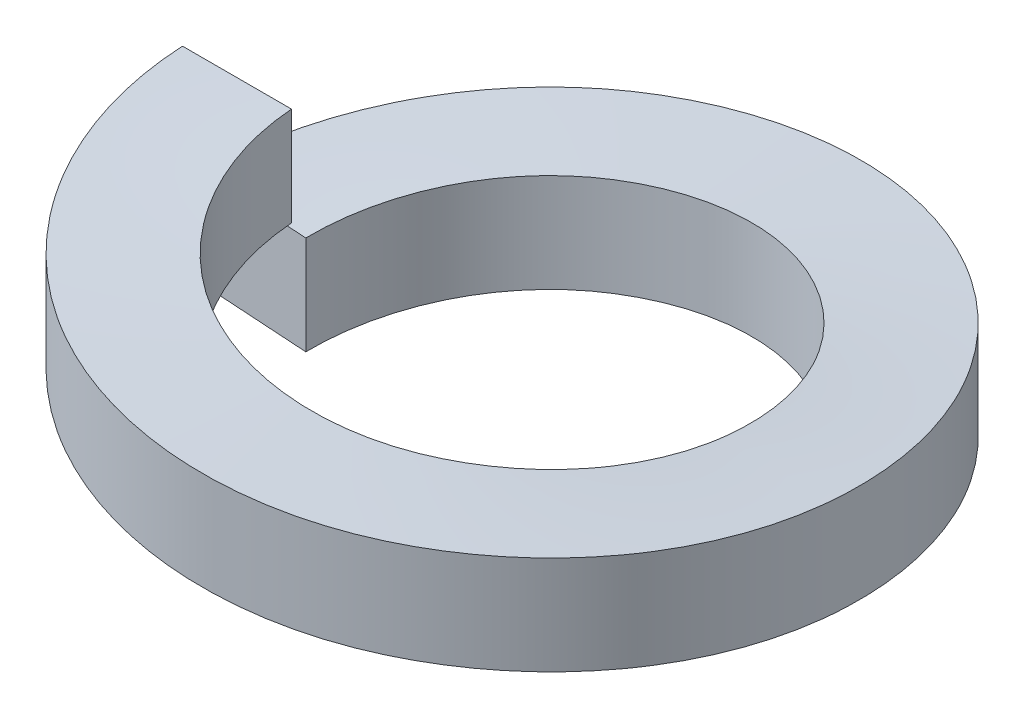
ISO-10303-21;
HEADER;
FILE_DESCRIPTION(('STEP AP214'),'2;1');
FILE_NAME('part.step','',(''),(''),'','','');
FILE_SCHEMA(('AUTOMOTIVE_DESIGN { 1 0 10303 214 1 1 1 1 }'));
ENDSEC;
DATA;
#1=APPLICATION_CONTEXT('core data for automotive mechanical design processes');
#2=APPLICATION_PROTOCOL_DEFINITION('international standard','automotive_design',2000,#1);
#3=PRODUCT_CONTEXT('',#1,'mechanical');
#4=PRODUCT('Part','Part','',(#3));
#5=PRODUCT_RELATED_PRODUCT_CATEGORY('part','',(#4));
#6=PRODUCT_DEFINITION_FORMATION('','',#4);
#7=PRODUCT_DEFINITION_CONTEXT('part definition',#1,'design');
#8=PRODUCT_DEFINITION('design','',#6,#7);
#9=PRODUCT_DEFINITION_SHAPE('','',#8);
#10=(LENGTH_UNIT() NAMED_UNIT(*) SI_UNIT(.MILLI.,.METRE.));
#11=(NAMED_UNIT(*) PLANE_ANGLE_UNIT() SI_UNIT($,.RADIAN.));
#12=(NAMED_UNIT(*) SI_UNIT($,.STERADIAN.) SOLID_ANGLE_UNIT());
#13=UNCERTAINTY_MEASURE_WITH_UNIT(LENGTH_MEASURE(1.E-05),#10,'distance_accuracy_value','');
#14=(GEOMETRIC_REPRESENTATION_CONTEXT(3) GLOBAL_UNCERTAINTY_ASSIGNED_CONTEXT((#13)) GLOBAL_UNIT_ASSIGNED_CONTEXT((#10,
#11,#12)) REPRESENTATION_CONTEXT('',''));
#15=CARTESIAN_POINT('',(0.,0.,0.));
#16=DIRECTION('',(0.,0.,1.));
#17=DIRECTION('',(1.,0.,0.));
#18=AXIS2_PLACEMENT_3D('',#15,#16,#17);
#19=CARTESIAN_POINT('',(-6.35,0.,0.));
#20=DIRECTION('',(0.,0.,1.));
#21=DIRECTION('',(1.,0.,0.));
#22=AXIS2_PLACEMENT_3D('',#19,#20,#21);
#23=PLANE('',#22);
#24=DIRECTION('',(0.,-1.,0.));
#25=VECTOR('',#24,1.);
#26=CARTESIAN_POINT('',(-6.35,1.9,0.));
#27=LINE('',#26,#25);
#28=CARTESIAN_POINT('',(-6.35,1.9,0.));
#29=VERTEX_POINT('',#28);
#30=CARTESIAN_POINT('',(-6.35,0.,0.));
#31=VERTEX_POINT('',#30);
#32=EDGE_CURVE('E74',#29,#31,#27,.T.);
#33=ORIENTED_EDGE('',*,*,#32,.F.);
#34=DIRECTION('',(-1.,0.,0.));
#35=VECTOR('',#34,1.);
#36=CARTESIAN_POINT('',(-6.35,1.9,0.));
#37=LINE('',#36,#35);
#38=CARTESIAN_POINT('',(-4.25,1.9,0.));
#39=VERTEX_POINT('',#38);
#40=EDGE_CURVE('E62',#39,#29,#37,.T.);
#41=ORIENTED_EDGE('',*,*,#40,.F.);
#42=DIRECTION('',(0.,1.,0.));
#43=VECTOR('',#42,1.);
#44=CARTESIAN_POINT('',(-4.25,1.9,0.));
#45=LINE('',#44,#43);
#46=CARTESIAN_POINT('',(-4.25,0.,0.));
#47=VERTEX_POINT('',#46);
#48=EDGE_CURVE('E67',#47,#39,#45,.T.);
#49=ORIENTED_EDGE('',*,*,#48,.F.);
#50=DIRECTION('',(1.,0.,0.));
#51=VECTOR('',#50,1.);
#52=CARTESIAN_POINT('',(-6.35,0.,0.));
#53=LINE('',#52,#51);
#54=EDGE_CURVE('E71',#31,#47,#53,.T.);
#55=ORIENTED_EDGE('',*,*,#54,.F.);
#56=EDGE_LOOP('',(#33,#41,#49,#55));
#57=FACE_BOUND('',#56,.T.);
#58=ADVANCED_FACE('F32',(#57),#23,.F.);
#59=CARTESIAN_POINT('',(-6.33746972551953,-2.28,-0.398719799011055));
#60=DIRECTION('',(-0.0627905195293,0.,0.998026728428272));
#61=DIRECTION('',(0.998026728428272,0.,0.0627905195293));
#62=AXIS2_PLACEMENT_3D('',#59,#60,#61);
#63=PLANE('',#62);
#64=DIRECTION('',(0.,-1.,0.));
#65=VECTOR('',#64,1.);
#66=CARTESIAN_POINT('',(-6.33746972551953,-0.38,-0.398719799011055));
#67=LINE('',#66,#65);
#68=CARTESIAN_POINT('',(-6.33746972551953,-0.38,-0.398719799011052));
#69=VERTEX_POINT('',#68);
#70=CARTESIAN_POINT('',(-6.33746972551953,-2.28,-0.398719799011052));
#71=VERTEX_POINT('',#70);
#72=EDGE_CURVE('E88',#69,#71,#67,.T.);
#73=ORIENTED_EDGE('',*,*,#72,.T.);
#74=DIRECTION('',(0.998026728428272,0.,0.0627905195293));
#75=VECTOR('',#74,1.);
#76=CARTESIAN_POINT('',(-6.33746972551953,-2.28,-0.398719799011055));
#77=LINE('',#76,#75);
#78=CARTESIAN_POINT('',(-4.24161359582016,-2.28,-0.266859707999523));
#79=VERTEX_POINT('',#78);
#80=EDGE_CURVE('E51',#71,#79,#77,.T.);
#81=ORIENTED_EDGE('',*,*,#80,.T.);
#82=DIRECTION('',(0.,1.,0.));
#83=VECTOR('',#82,1.);
#84=CARTESIAN_POINT('',(-4.24161359582016,-0.38,-0.266859707999525));
#85=LINE('',#84,#83);
#86=CARTESIAN_POINT('',(-4.24161359582016,-0.38,-0.266859707999523));
#87=VERTEX_POINT('',#86);
#88=EDGE_CURVE('E45',#79,#87,#85,.T.);
#89=ORIENTED_EDGE('',*,*,#88,.T.);
#90=DIRECTION('',(-0.998026728428272,0.,-0.0627905195293));
#91=VECTOR('',#90,1.);
#92=CARTESIAN_POINT('',(-6.33746972551953,-0.38,-0.398719799011055));
#93=LINE('',#92,#91);
#94=EDGE_CURVE('E11',#87,#69,#93,.T.);
#95=ORIENTED_EDGE('',*,*,#94,.T.);
#96=EDGE_LOOP('',(#73,#81,#89,#95));
#97=FACE_BOUND('',#96,.T.);
#98=ADVANCED_FACE('F133',(#97),#63,.T.);
#99=CARTESIAN_POINT('',(0.,0.,0.));
#100=DIRECTION('',(0.,-1.,0.));
#101=DIRECTION('',(0.,0.,-1.));
#102=AXIS2_PLACEMENT_3D('',#99,#100,#101);
#103=CYLINDRICAL_SURFACE('',#102,6.35);
#104=CARTESIAN_POINT('',(-6.35,0.,0.));
#105=CARTESIAN_POINT('',(-6.35,-0.19,3.62197605342543));
#106=CARTESIAN_POINT('',(-3.23241299001484,-0.38,5.46571187147505));
#107=CARTESIAN_POINT('',(-0.114825980029689,-0.57,7.30944768952467));
#108=CARTESIAN_POINT('',(3.05913583054592,-0.76,5.56454741827852));
#109=CARTESIAN_POINT('',(6.23309764112153,-0.95,3.81964714703237));
#110=CARTESIAN_POINT('',(6.3468666583224,-1.14,0.199458320146069));
#111=CARTESIAN_POINT('',(6.46063567552327,-1.33,-3.42073050674023));
#112=CARTESIAN_POINT('',(3.40250014811658,-1.52,-5.36148232693783));
#113=CARTESIAN_POINT('',(0.344364620709888,-1.71,-7.30223414713542));
#114=CARTESIAN_POINT('',(-2.88283967334619,-1.9,-5.6578914285961));
#115=CARTESIAN_POINT('',(-6.11004396740227,-2.09,-4.01354871005678));
#116=CARTESIAN_POINT('',(-6.33746972551953,-2.28,-0.398719799011049));
#117=(BOUNDED_CURVE() B_SPLINE_CURVE(2,(#104,#105,#106,#107,#108,#109,#110,#111,#112,#113,#114,
#115,#116),.UNSPECIFIED.,.F.,.F.) B_SPLINE_CURVE_WITH_KNOTS((3,2,2,2,2,2,3),(0.,
0.166666666666667,0.333333333333333,0.5,0.666666666666667,0.833333333333333,1.),
.UNSPECIFIED.) CURVE() GEOMETRIC_REPRESENTATION_ITEM() RATIONAL_B_SPLINE_CURVE((1.,
0.868631514438191,1.,0.868631514438191,1.,0.868631514438191,1.,0.868631514438191,1.,
0.868631514438191,1.,0.868631514438191,1.)) REPRESENTATION_ITEM(''));
#118=EDGE_CURVE('E90',#31,#71,#117,.T.);
#119=ORIENTED_EDGE('',*,*,#118,.T.);
#120=ORIENTED_EDGE('',*,*,#72,.F.);
#121=CARTESIAN_POINT('',(-6.35,1.9,0.));
#122=CARTESIAN_POINT('',(-6.35,1.71,3.62197605342543));
#123=CARTESIAN_POINT('',(-3.23241299001484,1.52,5.46571187147505));
#124=CARTESIAN_POINT('',(-0.114825980029689,1.33,7.30944768952467));
#125=CARTESIAN_POINT('',(3.05913583054592,1.14,5.56454741827852));
#126=CARTESIAN_POINT('',(6.23309764112153,0.95,3.81964714703237));
#127=CARTESIAN_POINT('',(6.3468666583224,0.76,0.199458320146069));
#128=CARTESIAN_POINT('',(6.46063567552327,0.57,-3.42073050674023));
#129=CARTESIAN_POINT('',(3.40250014811658,0.38,-5.36148232693783));
#130=CARTESIAN_POINT('',(0.344364620709888,0.19,-7.30223414713542));
#131=CARTESIAN_POINT('',(-2.88283967334619,0.,-5.6578914285961));
#132=CARTESIAN_POINT('',(-6.11004396740227,-0.19,-4.01354871005678));
#133=CARTESIAN_POINT('',(-6.33746972551953,-0.38,-0.398719799011049));
#134=(BOUNDED_CURVE() B_SPLINE_CURVE(2,(#121,#122,#123,#124,#125,#126,#127,#128,#129,#130,#131,
#132,#133),.UNSPECIFIED.,.F.,.F.) B_SPLINE_CURVE_WITH_KNOTS((3,2,2,2,2,2,3),(0.,
0.166666666666667,0.333333333333333,0.5,0.666666666666667,0.833333333333333,1.),
.UNSPECIFIED.) CURVE() GEOMETRIC_REPRESENTATION_ITEM() RATIONAL_B_SPLINE_CURVE((1.,
0.868631514438191,1.,0.868631514438191,1.,0.868631514438191,1.,0.868631514438191,1.,
0.868631514438191,1.,0.868631514438191,1.)) REPRESENTATION_ITEM(''));
#135=EDGE_CURVE('E84',#29,#69,#134,.T.);
#136=ORIENTED_EDGE('',*,*,#135,.F.);
#137=ORIENTED_EDGE('',*,*,#32,.T.);
#138=EDGE_LOOP('',(#119,#120,#136,#137));
#139=FACE_BOUND('',#138,.T.);
#140=ADVANCED_FACE('F87',(#139),#103,.T.);
#141=CARTESIAN_POINT('',(-6.35,0.,0.));
#142=CARTESIAN_POINT('',(-6.35,-0.19,3.62197605342543));
#143=CARTESIAN_POINT('',(-3.23241299001484,-0.38,5.46571187147505));
#144=CARTESIAN_POINT('',(-0.114825980029689,-0.57,7.30944768952467));
#145=CARTESIAN_POINT('',(3.05913583054592,-0.76,5.56454741827852));
#146=CARTESIAN_POINT('',(6.23309764112153,-0.95,3.81964714703237));
#147=CARTESIAN_POINT('',(6.3468666583224,-1.14,0.199458320146069));
#148=CARTESIAN_POINT('',(6.46063567552327,-1.33,-3.42073050674023));
#149=CARTESIAN_POINT('',(3.40250014811658,-1.52,-5.36148232693783));
#150=CARTESIAN_POINT('',(0.344364620709888,-1.71,-7.30223414713542));
#151=CARTESIAN_POINT('',(-2.88283967334619,-1.9,-5.6578914285961));
#152=CARTESIAN_POINT('',(-6.11004396740227,-2.09,-4.01354871005678));
#153=CARTESIAN_POINT('',(-6.33746972551953,-2.28,-0.398719799011049));
#154=CARTESIAN_POINT('',(-4.25,0.,0.));
#155=CARTESIAN_POINT('',(-4.25,-0.19,2.42415720111151));
#156=CARTESIAN_POINT('',(-2.16342601693907,-0.38,3.65815361476677));
#157=CARTESIAN_POINT('',(-0.0768520338781386,-0.57,4.89215002842202));
#158=CARTESIAN_POINT('',(2.04745311493231,-0.76,3.72430339018641));
#159=CARTESIAN_POINT('',(4.17175826374275,-0.95,2.5564567519508));
#160=CARTESIAN_POINT('',(4.24790288155436,-1.14,0.133495726082015));
#161=CARTESIAN_POINT('',(4.32404749936597,-1.33,-2.28946529978677));
#162=CARTESIAN_POINT('',(2.2772638786607,-1.52,-3.58839368338359));
#163=CARTESIAN_POINT('',(0.230480257955437,-1.71,-4.8873220669804));
#164=CARTESIAN_POINT('',(-1.92945962389312,-1.9,-3.78677772780054));
#165=CARTESIAN_POINT('',(-4.08939950574167,-2.09,-2.68623338862068));
#166=CARTESIAN_POINT('',(-4.24161359582016,-2.28,-0.266859707999521));
#167=(BOUNDED_SURFACE() B_SPLINE_SURFACE(1,2,((#141,#142,#143,#144,#145,#146,#147,#148,#149,
#150,#151,#152,#153),(#154,#155,#156,#157,#158,#159,#160,#161,#162,#163,#164,#165,#166)),
.UNSPECIFIED.,.F.,.F.,.F.) B_SPLINE_SURFACE_WITH_KNOTS((2,2),(3,2,2,2,2,2,3),(0.,1.),(0.,
0.166666666666667,0.333333333333333,0.5,0.666666666666667,0.833333333333333,1.),
.UNSPECIFIED.) GEOMETRIC_REPRESENTATION_ITEM() RATIONAL_B_SPLINE_SURFACE(((1.,0.868631514438191,
1.,0.868631514438191,1.,0.868631514438191,1.,0.868631514438191,1.,0.868631514438191,1.,
0.868631514438191,1.),(1.,0.868631514438191,1.,0.868631514438191,1.,0.868631514438191,1.,
0.868631514438191,1.,0.868631514438191,1.,0.868631514438191,1.))) REPRESENTATION_ITEM('') SURFACE());
#168=CARTESIAN_POINT('',(-4.25,0.,0.));
#169=CARTESIAN_POINT('',(-4.25,-0.19,2.42415720111151));
#170=CARTESIAN_POINT('',(-2.16342601693907,-0.38,3.65815361476677));
#171=CARTESIAN_POINT('',(-0.0768520338781386,-0.57,4.89215002842202));
#172=CARTESIAN_POINT('',(2.04745311493231,-0.76,3.72430339018641));
#173=CARTESIAN_POINT('',(4.17175826374275,-0.95,2.5564567519508));
#174=CARTESIAN_POINT('',(4.24790288155436,-1.14,0.133495726082015));
#175=CARTESIAN_POINT('',(4.32404749936597,-1.33,-2.28946529978677));
#176=CARTESIAN_POINT('',(2.2772638786607,-1.52,-3.58839368338359));
#177=CARTESIAN_POINT('',(0.230480257955437,-1.71,-4.8873220669804));
#178=CARTESIAN_POINT('',(-1.92945962389312,-1.9,-3.78677772780054));
#179=CARTESIAN_POINT('',(-4.08939950574167,-2.09,-2.68623338862068));
#180=CARTESIAN_POINT('',(-4.24161359582016,-2.28,-0.266859707999521));
#181=(BOUNDED_CURVE() B_SPLINE_CURVE(2,(#168,#169,#170,#171,#172,#173,#174,#175,#176,#177,#178,
#179,#180),.UNSPECIFIED.,.F.,.F.) B_SPLINE_CURVE_WITH_KNOTS((3,2,2,2,2,2,3),(0.,
0.166666666666667,0.333333333333333,0.5,0.666666666666667,0.833333333333333,1.),
.UNSPECIFIED.) CURVE() GEOMETRIC_REPRESENTATION_ITEM() RATIONAL_B_SPLINE_CURVE((1.,
0.868631514438191,1.,0.868631514438191,1.,0.868631514438191,1.,0.868631514438191,1.,
0.868631514438191,1.,0.868631514438191,1.)) REPRESENTATION_ITEM(''));
#182=EDGE_CURVE('E104',#47,#79,#181,.T.);
#183=ORIENTED_EDGE('',*,*,#182,.T.);
#184=ORIENTED_EDGE('',*,*,#80,.F.);
#185=ORIENTED_EDGE('',*,*,#118,.F.);
#186=ORIENTED_EDGE('',*,*,#54,.T.);
#187=EDGE_LOOP('',(#183,#184,#185,#186));
#188=FACE_BOUND('',#187,.T.);
#189=ADVANCED_FACE('F125',(#188),#167,.T.);
#190=CARTESIAN_POINT('',(0.,0.,0.));
#191=DIRECTION('',(0.,-1.,0.));
#192=DIRECTION('',(0.,0.,-1.));
#193=AXIS2_PLACEMENT_3D('',#190,#191,#192);
#194=CYLINDRICAL_SURFACE('',#193,4.25);
#195=CARTESIAN_POINT('',(-4.25,1.9,0.));
#196=CARTESIAN_POINT('',(-4.25,1.71,2.42415720111151));
#197=CARTESIAN_POINT('',(-2.16342601693907,1.52,3.65815361476677));
#198=CARTESIAN_POINT('',(-0.0768520338781386,1.33,4.89215002842202));
#199=CARTESIAN_POINT('',(2.04745311493231,1.14,3.72430339018641));
#200=CARTESIAN_POINT('',(4.17175826374275,0.95,2.5564567519508));
#201=CARTESIAN_POINT('',(4.24790288155436,0.76,0.133495726082015));
#202=CARTESIAN_POINT('',(4.32404749936597,0.57,-2.28946529978677));
#203=CARTESIAN_POINT('',(2.2772638786607,0.38,-3.58839368338359));
#204=CARTESIAN_POINT('',(0.230480257955437,0.19,-4.8873220669804));
#205=CARTESIAN_POINT('',(-1.92945962389312,0.,-3.78677772780054));
#206=CARTESIAN_POINT('',(-4.08939950574167,-0.19,-2.68623338862068));
#207=CARTESIAN_POINT('',(-4.24161359582016,-0.38,-0.266859707999521));
#208=(BOUNDED_CURVE() B_SPLINE_CURVE(2,(#195,#196,#197,#198,#199,#200,#201,#202,#203,#204,#205,
#206,#207),.UNSPECIFIED.,.F.,.F.) B_SPLINE_CURVE_WITH_KNOTS((3,2,2,2,2,2,3),(0.,
0.166666666666667,0.333333333333333,0.5,0.666666666666667,0.833333333333333,1.),
.UNSPECIFIED.) CURVE() GEOMETRIC_REPRESENTATION_ITEM() RATIONAL_B_SPLINE_CURVE((1.,
0.868631514438191,1.,0.868631514438191,1.,0.868631514438191,1.,0.868631514438191,1.,
0.868631514438191,1.,0.868631514438191,1.)) REPRESENTATION_ITEM(''));
#209=EDGE_CURVE('E39',#39,#87,#208,.T.);
#210=ORIENTED_EDGE('',*,*,#209,.T.);
#211=ORIENTED_EDGE('',*,*,#88,.F.);
#212=ORIENTED_EDGE('',*,*,#182,.F.);
#213=ORIENTED_EDGE('',*,*,#48,.T.);
#214=EDGE_LOOP('',(#210,#211,#212,#213));
#215=FACE_BOUND('',#214,.T.);
#216=ADVANCED_FACE('F122',(#215),#194,.F.);
#217=CARTESIAN_POINT('',(-4.25,1.9,0.));
#218=CARTESIAN_POINT('',(-4.25,1.71,2.42415720111151));
#219=CARTESIAN_POINT('',(-2.16342601693907,1.52,3.65815361476677));
#220=CARTESIAN_POINT('',(-0.0768520338781386,1.33,4.89215002842202));
#221=CARTESIAN_POINT('',(2.04745311493231,1.14,3.72430339018641));
#222=CARTESIAN_POINT('',(4.17175826374275,0.95,2.5564567519508));
#223=CARTESIAN_POINT('',(4.24790288155436,0.76,0.133495726082015));
#224=CARTESIAN_POINT('',(4.32404749936597,0.57,-2.28946529978677));
#225=CARTESIAN_POINT('',(2.2772638786607,0.38,-3.58839368338359));
#226=CARTESIAN_POINT('',(0.230480257955437,0.19,-4.8873220669804));
#227=CARTESIAN_POINT('',(-1.92945962389312,0.,-3.78677772780054));
#228=CARTESIAN_POINT('',(-4.08939950574167,-0.19,-2.68623338862068));
#229=CARTESIAN_POINT('',(-4.24161359582016,-0.38,-0.266859707999521));
#230=CARTESIAN_POINT('',(-6.35,1.9,0.));
#231=CARTESIAN_POINT('',(-6.35,1.71,3.62197605342543));
#232=CARTESIAN_POINT('',(-3.23241299001484,1.52,5.46571187147505));
#233=CARTESIAN_POINT('',(-0.114825980029689,1.33,7.30944768952467));
#234=CARTESIAN_POINT('',(3.05913583054592,1.14,5.56454741827852));
#235=CARTESIAN_POINT('',(6.23309764112153,0.95,3.81964714703237));
#236=CARTESIAN_POINT('',(6.3468666583224,0.76,0.199458320146069));
#237=CARTESIAN_POINT('',(6.46063567552327,0.57,-3.42073050674023));
#238=CARTESIAN_POINT('',(3.40250014811658,0.38,-5.36148232693783));
#239=CARTESIAN_POINT('',(0.344364620709888,0.19,-7.30223414713542));
#240=CARTESIAN_POINT('',(-2.88283967334619,0.,-5.6578914285961));
#241=CARTESIAN_POINT('',(-6.11004396740227,-0.19,-4.01354871005678));
#242=CARTESIAN_POINT('',(-6.33746972551953,-0.38,-0.398719799011049));
#243=(BOUNDED_SURFACE() B_SPLINE_SURFACE(1,2,((#217,#218,#219,#220,#221,#222,#223,#224,#225,
#226,#227,#228,#229),(#230,#231,#232,#233,#234,#235,#236,#237,#238,#239,#240,#241,#242)),
.UNSPECIFIED.,.F.,.F.,.F.) B_SPLINE_SURFACE_WITH_KNOTS((2,2),(3,2,2,2,2,2,3),(0.,1.),(0.,
0.166666666666667,0.333333333333333,0.5,0.666666666666667,0.833333333333333,1.),
.UNSPECIFIED.) GEOMETRIC_REPRESENTATION_ITEM() RATIONAL_B_SPLINE_SURFACE(((1.,0.868631514438191,
1.,0.868631514438191,1.,0.868631514438191,1.,0.868631514438191,1.,0.868631514438191,1.,
0.868631514438191,1.),(1.,0.868631514438191,1.,0.868631514438191,1.,0.868631514438191,1.,
0.868631514438191,1.,0.868631514438191,1.,0.868631514438191,1.))) REPRESENTATION_ITEM('') SURFACE());
#244=ORIENTED_EDGE('',*,*,#94,.F.);
#245=ORIENTED_EDGE('',*,*,#209,.F.);
#246=ORIENTED_EDGE('',*,*,#40,.T.);
#247=ORIENTED_EDGE('',*,*,#135,.T.);
#248=EDGE_LOOP('',(#244,#245,#246,#247));
#249=FACE_BOUND('',#248,.T.);
#250=ADVANCED_FACE('F83',(#249),#243,.T.);
#251=CLOSED_SHELL('',(#58,#98,#140,#189,#216,#250));
#252=MANIFOLD_SOLID_BREP('B2',#251);
#253=ADVANCED_BREP_SHAPE_REPRESENTATION('',(#18,#252),#14);
#254=SHAPE_DEFINITION_REPRESENTATION(#9,#253);
ENDSEC;
END-ISO-10303-21;
